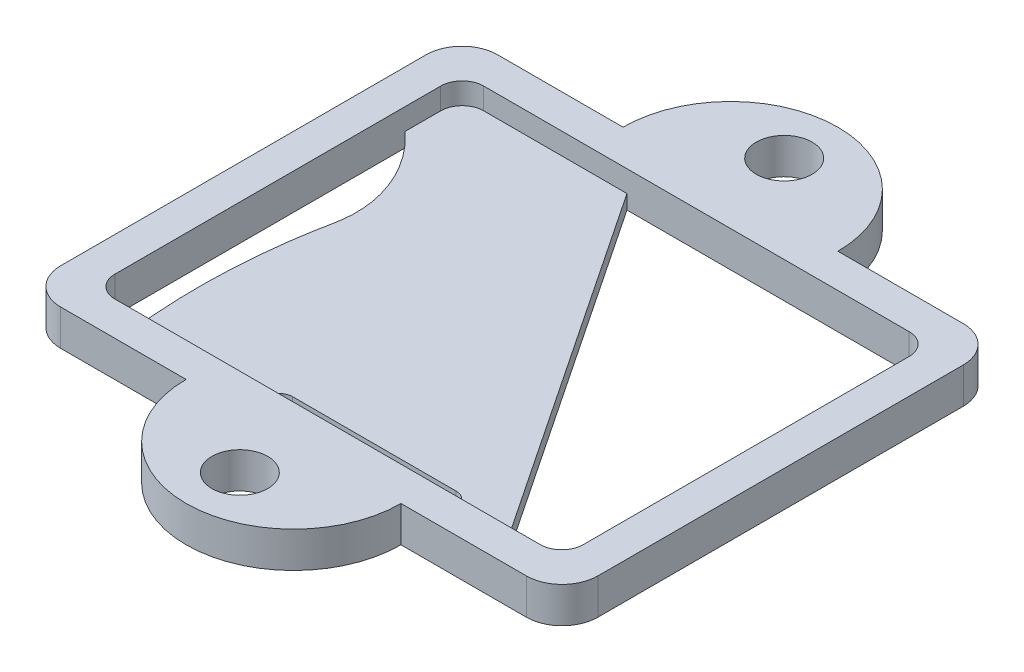
ISO-10303-21;
HEADER;
FILE_DESCRIPTION(('STEP AP214'),'2;1');
FILE_NAME('part.step','',(''),(''),'','','');
FILE_SCHEMA(('AUTOMOTIVE_DESIGN { 1 0 10303 214 1 1 1 1 }'));
ENDSEC;
DATA;
#1=APPLICATION_CONTEXT('core data for automotive mechanical design processes');
#2=APPLICATION_PROTOCOL_DEFINITION('international standard','automotive_design',2000,#1);
#3=PRODUCT_CONTEXT('',#1,'mechanical');
#4=PRODUCT('Part','Part','',(#3));
#5=PRODUCT_RELATED_PRODUCT_CATEGORY('part','',(#4));
#6=PRODUCT_DEFINITION_FORMATION('','',#4);
#7=PRODUCT_DEFINITION_CONTEXT('part definition',#1,'design');
#8=PRODUCT_DEFINITION('design','',#6,#7);
#9=PRODUCT_DEFINITION_SHAPE('','',#8);
#10=(LENGTH_UNIT() NAMED_UNIT(*) SI_UNIT(.MILLI.,.METRE.));
#11=(NAMED_UNIT(*) PLANE_ANGLE_UNIT() SI_UNIT($,.RADIAN.));
#12=(NAMED_UNIT(*) SI_UNIT($,.STERADIAN.) SOLID_ANGLE_UNIT());
#13=UNCERTAINTY_MEASURE_WITH_UNIT(LENGTH_MEASURE(1.E-05),#10,'distance_accuracy_value','');
#14=(GEOMETRIC_REPRESENTATION_CONTEXT(3) GLOBAL_UNCERTAINTY_ASSIGNED_CONTEXT((#13)) GLOBAL_UNIT_ASSIGNED_CONTEXT((#10,
#11,#12)) REPRESENTATION_CONTEXT('',''));
#15=CARTESIAN_POINT('',(0.,0.,0.));
#16=DIRECTION('',(0.,0.,1.));
#17=DIRECTION('',(1.,0.,0.));
#18=AXIS2_PLACEMENT_3D('',#15,#16,#17);
#19=CARTESIAN_POINT('',(0.,2.,0.));
#20=DIRECTION('',(0.,1.,0.));
#21=DIRECTION('',(0.,0.,1.));
#22=AXIS2_PLACEMENT_3D('',#19,#20,#21);
#23=PLANE('',#22);
#24=DIRECTION('',(1.,0.,0.));
#25=VECTOR('',#24,1.);
#26=CARTESIAN_POINT('',(0.,2.,-56.25));
#27=LINE('',#26,#25);
#28=CARTESIAN_POINT('',(-67.2,2.,-56.25));
#29=VERTEX_POINT('',#28);
#30=CARTESIAN_POINT('',(-47.2,2.,-56.25));
#31=VERTEX_POINT('',#30);
#32=EDGE_CURVE('E574',#29,#31,#27,.T.);
#33=ORIENTED_EDGE('',*,*,#32,.F.);
#34=CARTESIAN_POINT('',(-67.2,2.,-53.25));
#35=DIRECTION('',(0.,1.,0.));
#36=DIRECTION('',(0.,0.,1.));
#37=AXIS2_PLACEMENT_3D('',#34,#35,#36);
#38=CIRCLE('',#37,3.);
#39=CARTESIAN_POINT('',(-70.2,2.,-53.25));
#40=VERTEX_POINT('',#39);
#41=EDGE_CURVE('E480',#29,#40,#38,.T.);
#42=ORIENTED_EDGE('',*,*,#41,.T.);
#43=DIRECTION('',(0.,0.,-1.));
#44=VECTOR('',#43,1.);
#45=CARTESIAN_POINT('',(-70.2,2.,0.));
#46=LINE('',#45,#44);
#47=CARTESIAN_POINT('',(-70.2,2.,-48.25));
#48=VERTEX_POINT('',#47);
#49=EDGE_CURVE('E533',#48,#40,#46,.T.);
#50=ORIENTED_EDGE('',*,*,#49,.F.);
#51=CARTESIAN_POINT('',(-70.2,2.,-48.25));
#52=CARTESIAN_POINT('',(-69.3360201996051,2.,-47.3934085351359));
#53=CARTESIAN_POINT('',(-68.4841652961007,2.,-46.5268852184293));
#54=B_SPLINE_CURVE_WITH_KNOTS('',2,(#51,#52,#53),.UNSPECIFIED.,.F.,.F.,(3,3),(0.,
0.0445127924198066),.UNSPECIFIED.);
#55=CARTESIAN_POINT('',(-68.4841652961007,2.,-46.5268852184293));
#56=VERTEX_POINT('',#55);
#57=EDGE_CURVE('E555',#48,#56,#54,.T.);
#58=ORIENTED_EDGE('',*,*,#57,.T.);
#59=CARTESIAN_POINT('',(-70.2,2.,-48.25));
#60=CARTESIAN_POINT('',(-65.7809817664033,2.,-44.3103853015989));
#61=CARTESIAN_POINT('',(-62.8458311822307,2.,-38.221217770015));
#62=CARTESIAN_POINT('',(-64.0829675839587,2.,-32.2701671160842));
#63=B_SPLINE_CURVE_WITH_KNOTS('',3,(#59,#60,#61,#62),.UNSPECIFIED.,.F.,.F.,(4,4),(0.,1.),.UNSPECIFIED.);
#64=CARTESIAN_POINT('',(-64.0606165324306,2.,-32.379972514167));
#65=VERTEX_POINT('',#64);
#66=EDGE_CURVE('E344',#56,#65,#63,.T.);
#67=ORIENTED_EDGE('',*,*,#66,.T.);
#68=CARTESIAN_POINT('',(-65.2,2.,-4.74999999999999));
#69=CARTESIAN_POINT('',(-66.28590342917,2.,-14.1333819415866));
#70=CARTESIAN_POINT('',(-65.9061089399868,2.,-23.3433727796108));
#71=CARTESIAN_POINT('',(-64.0606165324306,2.,-32.379972514167));
#72=B_SPLINE_CURVE_WITH_KNOTS('',3,(#68,#69,#70,#71),.UNSPECIFIED.,.F.,.F.,(4,4),(0.,
0.783884553660671),.UNSPECIFIED.);
#73=CARTESIAN_POINT('',(-65.2,2.,-4.74999999999999));
#74=VERTEX_POINT('',#73);
#75=EDGE_CURVE('E353',#74,#65,#72,.T.);
#76=ORIENTED_EDGE('',*,*,#75,.F.);
#77=DIRECTION('',(1.,0.,0.));
#78=VECTOR('',#77,1.);
#79=CARTESIAN_POINT('',(0.,2.,-4.74999999999999));
#80=LINE('',#79,#78);
#81=CARTESIAN_POINT('',(-47.7958168890493,2.,-4.74999999999999));
#82=VERTEX_POINT('',#81);
#83=EDGE_CURVE('E532',#74,#82,#80,.T.);
#84=ORIENTED_EDGE('',*,*,#83,.T.);
#85=DIRECTION('',(0.,0.,1.));
#86=VECTOR('',#85,1.);
#87=CARTESIAN_POINT('',(-47.7958168890493,2.,0.));
#88=LINE('',#87,#86);
#89=CARTESIAN_POINT('',(-47.7958168890493,2.,-6.54999999999999));
#90=VERTEX_POINT('',#89);
#91=EDGE_CURVE('E298',#90,#82,#88,.T.);
#92=ORIENTED_EDGE('',*,*,#91,.F.);
#93=CARTESIAN_POINT('',(-45.9958168890493,2.,-6.54999999999999));
#94=DIRECTION('',(0.,1.,0.));
#95=DIRECTION('',(0.,0.,1.));
#96=AXIS2_PLACEMENT_3D('',#93,#94,#95);
#97=CIRCLE('',#96,1.8);
#98=CARTESIAN_POINT('',(-45.9958168890493,2.,-8.34999999999999));
#99=VERTEX_POINT('',#98);
#100=EDGE_CURVE('E300',#99,#90,#97,.T.);
#101=ORIENTED_EDGE('',*,*,#100,.F.);
#102=DIRECTION('',(1.,0.,0.));
#103=VECTOR('',#102,1.);
#104=CARTESIAN_POINT('',(0.,2.,-8.34999999999999));
#105=LINE('',#104,#103);
#106=CARTESIAN_POINT('',(-23.1411626663158,2.,-8.34999999999999));
#107=VERTEX_POINT('',#106);
#108=EDGE_CURVE('E313',#99,#107,#105,.T.);
#109=ORIENTED_EDGE('',*,*,#108,.T.);
#110=CARTESIAN_POINT('',(-23.1411626663158,2.,-6.54999999999999));
#111=DIRECTION('',(0.,1.,0.));
#112=DIRECTION('',(0.,0.,1.));
#113=AXIS2_PLACEMENT_3D('',#110,#111,#112);
#114=CIRCLE('',#113,1.8);
#115=CARTESIAN_POINT('',(-21.3411626663158,2.,-6.54999999999999));
#116=VERTEX_POINT('',#115);
#117=EDGE_CURVE('E311',#116,#107,#114,.T.);
#118=ORIENTED_EDGE('',*,*,#117,.F.);
#119=DIRECTION('',(0.,0.,1.));
#120=VECTOR('',#119,1.);
#121=CARTESIAN_POINT('',(-21.3411626663158,2.,0.));
#122=LINE('',#121,#120);
#123=CARTESIAN_POINT('',(-21.3411626663158,2.,-4.74999999999999));
#124=VERTEX_POINT('',#123);
#125=EDGE_CURVE('E279',#116,#124,#122,.T.);
#126=ORIENTED_EDGE('',*,*,#125,.T.);
#127=CARTESIAN_POINT('',(-12.8,2.,-4.74999999999999));
#128=VERTEX_POINT('',#127);
#129=EDGE_CURVE('E529',#124,#128,#80,.T.);
#130=ORIENTED_EDGE('',*,*,#129,.T.);
#131=DIRECTION('',(0.555445204331323,0.,0.831553140205324));
#132=VECTOR('',#131,1.);
#133=CARTESIAN_POINT('',(-6.65701153141222,2.,4.4466251782637));
#134=LINE('',#133,#132);
#135=EDGE_CURVE('E320',#31,#128,#134,.T.);
#136=ORIENTED_EDGE('',*,*,#135,.F.);
#137=EDGE_LOOP('',(#33,#42,#50,#58,#67,#76,#84,#92,#101,#109,#118,#126,#130,#136));
#138=FACE_BOUND('',#137,.T.);
#139=ADVANCED_FACE('F63',(#138),#23,.T.);
#140=CARTESIAN_POINT('',(0.,0.,0.));
#141=DIRECTION('',(0.,1.,0.));
#142=DIRECTION('',(0.,0.,1.));
#143=AXIS2_PLACEMENT_3D('',#140,#141,#142);
#144=PLANE('',#143);
#145=CARTESIAN_POINT('',(-70.2,0.,-48.25));
#146=CARTESIAN_POINT('',(-65.7809817664033,0.,-44.3103853015989));
#147=CARTESIAN_POINT('',(-62.8458311822307,0.,-38.221217770015));
#148=CARTESIAN_POINT('',(-64.0829675839587,0.,-32.2701671160842));
#149=B_SPLINE_CURVE_WITH_KNOTS('',3,(#145,#146,#147,#148),.UNSPECIFIED.,.F.,.F.,(4,4),(0.,1.),.UNSPECIFIED.);
#150=CARTESIAN_POINT('',(-68.4841652961007,0.,-46.5268852184293));
#151=VERTEX_POINT('',#150);
#152=CARTESIAN_POINT('',(-64.0606165324306,0.,-32.379972514167));
#153=VERTEX_POINT('',#152);
#154=EDGE_CURVE('E347',#151,#153,#149,.T.);
#155=ORIENTED_EDGE('',*,*,#154,.F.);
#156=CARTESIAN_POINT('',(-70.2,0.,-48.25));
#157=CARTESIAN_POINT('',(-69.3360201996051,0.,-47.3934085351359));
#158=CARTESIAN_POINT('',(-68.4841652961007,0.,-46.5268852184293));
#159=B_SPLINE_CURVE_WITH_KNOTS('',2,(#156,#157,#158),.UNSPECIFIED.,.F.,.F.,(3,3),(0.,
0.0445127924198066),.UNSPECIFIED.);
#160=CARTESIAN_POINT('',(-70.2,0.,-48.25));
#161=VERTEX_POINT('',#160);
#162=EDGE_CURVE('E352',#161,#151,#159,.T.);
#163=ORIENTED_EDGE('',*,*,#162,.F.);
#164=DIRECTION('',(0.,0.,1.));
#165=VECTOR('',#164,1.);
#166=CARTESIAN_POINT('',(-70.2,0.,0.));
#167=LINE('',#166,#165);
#168=CARTESIAN_POINT('',(-70.2,0.,-7.74999999999999));
#169=VERTEX_POINT('',#168);
#170=EDGE_CURVE('E1007',#161,#169,#167,.T.);
#171=ORIENTED_EDGE('',*,*,#170,.T.);
#172=CARTESIAN_POINT('',(-67.2,0.,-7.74999999999999));
#173=DIRECTION('',(0.,1.,0.));
#174=DIRECTION('',(0.,0.,1.));
#175=AXIS2_PLACEMENT_3D('',#172,#173,#174);
#176=CIRCLE('',#175,3.);
#177=CARTESIAN_POINT('',(-67.2,0.,-4.74999999999999));
#178=VERTEX_POINT('',#177);
#179=EDGE_CURVE('E466',#169,#178,#176,.T.);
#180=ORIENTED_EDGE('',*,*,#179,.T.);
#181=DIRECTION('',(1.,0.,0.));
#182=VECTOR('',#181,1.);
#183=CARTESIAN_POINT('',(0.,0.,-4.74999999999999));
#184=LINE('',#183,#182);
#185=CARTESIAN_POINT('',(-65.2,0.,-4.74999999999999));
#186=VERTEX_POINT('',#185);
#187=EDGE_CURVE('E1003',#178,#186,#184,.T.);
#188=ORIENTED_EDGE('',*,*,#187,.T.);
#189=CARTESIAN_POINT('',(-65.2,0.,-4.74999999999999));
#190=CARTESIAN_POINT('',(-66.28590342917,0.,-14.1333819415866));
#191=CARTESIAN_POINT('',(-65.9061089399868,0.,-23.3433727796108));
#192=CARTESIAN_POINT('',(-64.0606165324306,0.,-32.379972514167));
#193=B_SPLINE_CURVE_WITH_KNOTS('',3,(#189,#190,#191,#192),.UNSPECIFIED.,.F.,.F.,(4,4),(0.,
0.783884553660671),.UNSPECIFIED.);
#194=EDGE_CURVE('E573',#186,#153,#193,.T.);
#195=ORIENTED_EDGE('',*,*,#194,.T.);
#196=EDGE_LOOP('',(#155,#163,#171,#180,#188,#195));
#197=FACE_BOUND('',#196,.T.);
#198=CARTESIAN_POINT('',(-37.5,0.,-68.5));
#199=DIRECTION('',(0.,1.,0.));
#200=DIRECTION('',(0.,0.,1.));
#201=AXIS2_PLACEMENT_3D('',#198,#199,#200);
#202=CIRCLE('',#201,3.9);
#203=CARTESIAN_POINT('',(-37.5,0.,-64.6));
#204=VERTEX_POINT('',#203);
#205=EDGE_CURVE('E550',#204,#204,#202,.T.);
#206=ORIENTED_EDGE('',*,*,#205,.T.);
#207=EDGE_LOOP('',(#206));
#208=FACE_BOUND('',#207,.T.);
#209=DIRECTION('',(0.,0.,-1.));
#210=VECTOR('',#209,1.);
#211=CARTESIAN_POINT('',(-75.,0.,0.));
#212=LINE('',#211,#210);
#213=CARTESIAN_POINT('',(-75.,0.,-5.));
#214=VERTEX_POINT('',#213);
#215=CARTESIAN_POINT('',(-75.,0.,-56.));
#216=VERTEX_POINT('',#215);
#217=EDGE_CURVE('E615',#214,#216,#212,.T.);
#218=ORIENTED_EDGE('',*,*,#217,.T.);
#219=CARTESIAN_POINT('',(-70.,0.,-56.));
#220=DIRECTION('',(0.,1.,0.));
#221=DIRECTION('',(0.,0.,1.));
#222=AXIS2_PLACEMENT_3D('',#219,#220,#221);
#223=CIRCLE('',#222,5.);
#224=CARTESIAN_POINT('',(-70.,0.,-61.));
#225=VERTEX_POINT('',#224);
#226=EDGE_CURVE('E515',#216,#225,#223,.F.);
#227=ORIENTED_EDGE('',*,*,#226,.T.);
#228=DIRECTION('',(-1.,0.,0.));
#229=VECTOR('',#228,1.);
#230=CARTESIAN_POINT('',(0.,0.,-61.));
#231=LINE('',#230,#229);
#232=CARTESIAN_POINT('',(-52.5,0.,-61.));
#233=VERTEX_POINT('',#232);
#234=EDGE_CURVE('E631',#233,#225,#231,.T.);
#235=ORIENTED_EDGE('',*,*,#234,.F.);
#236=CARTESIAN_POINT('',(-37.5,0.,-61.));
#237=DIRECTION('',(0.,1.,0.));
#238=DIRECTION('',(0.,0.,1.));
#239=AXIS2_PLACEMENT_3D('',#236,#237,#238);
#240=CIRCLE('',#239,15.);
#241=CARTESIAN_POINT('',(-22.5,0.,-61.));
#242=VERTEX_POINT('',#241);
#243=EDGE_CURVE('E630',#242,#233,#240,.T.);
#244=ORIENTED_EDGE('',*,*,#243,.F.);
#245=CARTESIAN_POINT('',(-5.,0.,-61.));
#246=VERTEX_POINT('',#245);
#247=EDGE_CURVE('E628',#246,#242,#231,.T.);
#248=ORIENTED_EDGE('',*,*,#247,.F.);
#249=CARTESIAN_POINT('',(-5.,0.,-56.));
#250=DIRECTION('',(0.,1.,0.));
#251=DIRECTION('',(0.,0.,1.));
#252=AXIS2_PLACEMENT_3D('',#249,#250,#251);
#253=CIRCLE('',#252,5.);
#254=CARTESIAN_POINT('',(0.,0.,-56.));
#255=VERTEX_POINT('',#254);
#256=EDGE_CURVE('E521',#246,#255,#253,.F.);
#257=ORIENTED_EDGE('',*,*,#256,.T.);
#258=DIRECTION('',(0.,0.,-1.));
#259=VECTOR('',#258,1.);
#260=CARTESIAN_POINT('',(0.,0.,0.));
#261=LINE('',#260,#259);
#262=CARTESIAN_POINT('',(0.,0.,-5.));
#263=VERTEX_POINT('',#262);
#264=EDGE_CURVE('E625',#263,#255,#261,.T.);
#265=ORIENTED_EDGE('',*,*,#264,.F.);
#266=CARTESIAN_POINT('',(-5.,0.,-5.));
#267=DIRECTION('',(0.,1.,0.));
#268=DIRECTION('',(0.,0.,1.));
#269=AXIS2_PLACEMENT_3D('',#266,#267,#268);
#270=CIRCLE('',#269,5.);
#271=CARTESIAN_POINT('',(-5.,0.,0.));
#272=VERTEX_POINT('',#271);
#273=EDGE_CURVE('E519',#263,#272,#270,.F.);
#274=ORIENTED_EDGE('',*,*,#273,.T.);
#275=DIRECTION('',(-1.,0.,0.));
#276=VECTOR('',#275,1.);
#277=CARTESIAN_POINT('',(0.,0.,0.));
#278=LINE('',#277,#276);
#279=CARTESIAN_POINT('',(-22.5,0.,0.));
#280=VERTEX_POINT('',#279);
#281=EDGE_CURVE('E622',#272,#280,#278,.T.);
#282=ORIENTED_EDGE('',*,*,#281,.T.);
#283=CARTESIAN_POINT('',(-37.5,0.,0.));
#284=DIRECTION('',(0.,1.,0.));
#285=DIRECTION('',(0.,0.,1.));
#286=AXIS2_PLACEMENT_3D('',#283,#284,#285);
#287=CIRCLE('',#286,15.);
#288=CARTESIAN_POINT('',(-52.5,0.,0.));
#289=VERTEX_POINT('',#288);
#290=EDGE_CURVE('E621',#280,#289,#287,.F.);
#291=ORIENTED_EDGE('',*,*,#290,.T.);
#292=CARTESIAN_POINT('',(-70.,0.,0.));
#293=VERTEX_POINT('',#292);
#294=EDGE_CURVE('E618',#289,#293,#278,.T.);
#295=ORIENTED_EDGE('',*,*,#294,.T.);
#296=CARTESIAN_POINT('',(-70.,0.,-5.));
#297=DIRECTION('',(0.,1.,0.));
#298=DIRECTION('',(0.,0.,1.));
#299=AXIS2_PLACEMENT_3D('',#296,#297,#298);
#300=CIRCLE('',#299,5.);
#301=EDGE_CURVE('E517',#293,#214,#300,.F.);
#302=ORIENTED_EDGE('',*,*,#301,.T.);
#303=EDGE_LOOP('',(#218,#227,#235,#244,#248,#257,#265,#274,#282,#291,#295,#302));
#304=FACE_BOUND('',#303,.T.);
#305=CARTESIAN_POINT('',(-37.5,0.,7.50000000000002));
#306=DIRECTION('',(0.,1.,0.));
#307=DIRECTION('',(0.,0.,1.));
#308=AXIS2_PLACEMENT_3D('',#305,#306,#307);
#309=CIRCLE('',#308,3.9);
#310=CARTESIAN_POINT('',(-37.5,0.,11.4));
#311=VERTEX_POINT('',#310);
#312=EDGE_CURVE('E590',#311,#311,#309,.F.);
#313=ORIENTED_EDGE('',*,*,#312,.F.);
#314=EDGE_LOOP('',(#313));
#315=FACE_BOUND('',#314,.T.);
#316=DIRECTION('',(1.,0.,0.));
#317=VECTOR('',#316,1.);
#318=CARTESIAN_POINT('',(0.,0.,-4.74999999999999));
#319=LINE('',#318,#317);
#320=CARTESIAN_POINT('',(-12.8,0.,-4.74999999999999));
#321=VERTEX_POINT('',#320);
#322=CARTESIAN_POINT('',(-7.80000000000001,0.,-4.74999999999999));
#323=VERTEX_POINT('',#322);
#324=EDGE_CURVE('E334',#321,#323,#319,.T.);
#325=ORIENTED_EDGE('',*,*,#324,.T.);
#326=CARTESIAN_POINT('',(-7.80000000000001,0.,-7.74999999999999));
#327=DIRECTION('',(0.,1.,0.));
#328=DIRECTION('',(0.,0.,1.));
#329=AXIS2_PLACEMENT_3D('',#326,#327,#328);
#330=CIRCLE('',#329,3.);
#331=CARTESIAN_POINT('',(-4.80000000000001,0.,-7.74999999999999));
#332=VERTEX_POINT('',#331);
#333=EDGE_CURVE('E85',#323,#332,#330,.T.);
#334=ORIENTED_EDGE('',*,*,#333,.T.);
#335=DIRECTION('',(0.,0.,-1.));
#336=VECTOR('',#335,1.);
#337=CARTESIAN_POINT('',(-4.80000000000001,0.,0.));
#338=LINE('',#337,#336);
#339=CARTESIAN_POINT('',(-4.80000000000001,0.,-53.25));
#340=VERTEX_POINT('',#339);
#341=EDGE_CURVE('E336',#332,#340,#338,.T.);
#342=ORIENTED_EDGE('',*,*,#341,.T.);
#343=CARTESIAN_POINT('',(-7.80000000000001,0.,-53.25));
#344=DIRECTION('',(0.,1.,0.));
#345=DIRECTION('',(0.,0.,1.));
#346=AXIS2_PLACEMENT_3D('',#343,#344,#345);
#347=CIRCLE('',#346,3.);
#348=CARTESIAN_POINT('',(-7.80000000000001,0.,-56.25));
#349=VERTEX_POINT('',#348);
#350=EDGE_CURVE('E12',#340,#349,#347,.T.);
#351=ORIENTED_EDGE('',*,*,#350,.T.);
#352=DIRECTION('',(-1.,0.,0.));
#353=VECTOR('',#352,1.);
#354=CARTESIAN_POINT('',(0.,0.,-56.25));
#355=LINE('',#354,#353);
#356=CARTESIAN_POINT('',(-47.2,0.,-56.25));
#357=VERTEX_POINT('',#356);
#358=EDGE_CURVE('E329',#349,#357,#355,.T.);
#359=ORIENTED_EDGE('',*,*,#358,.T.);
#360=DIRECTION('',(0.555445204331323,0.,0.831553140205324));
#361=VECTOR('',#360,1.);
#362=CARTESIAN_POINT('',(-6.65701153141222,0.,4.4466251782637));
#363=LINE('',#362,#361);
#364=EDGE_CURVE('E331',#357,#321,#363,.T.);
#365=ORIENTED_EDGE('',*,*,#364,.T.);
#366=EDGE_LOOP('',(#325,#334,#342,#351,#359,#365));
#367=FACE_BOUND('',#366,.T.);
#368=DIRECTION('',(0.,0.,1.));
#369=VECTOR('',#368,1.);
#370=CARTESIAN_POINT('',(-21.3411626663158,0.,0.));
#371=LINE('',#370,#369);
#372=CARTESIAN_POINT('',(-21.3411626663158,0.,-6.54999999999999));
#373=VERTEX_POINT('',#372);
#374=CARTESIAN_POINT('',(-21.3411626663158,0.,-4.74999999999999));
#375=VERTEX_POINT('',#374);
#376=EDGE_CURVE('E276',#373,#375,#371,.T.);
#377=ORIENTED_EDGE('',*,*,#376,.F.);
#378=CARTESIAN_POINT('',(-23.1411626663158,0.,-6.54999999999999));
#379=DIRECTION('',(0.,1.,0.));
#380=DIRECTION('',(0.,0.,1.));
#381=AXIS2_PLACEMENT_3D('',#378,#379,#380);
#382=CIRCLE('',#381,1.8);
#383=CARTESIAN_POINT('',(-23.1411626663158,0.,-8.34999999999999));
#384=VERTEX_POINT('',#383);
#385=EDGE_CURVE('E287',#373,#384,#382,.T.);
#386=ORIENTED_EDGE('',*,*,#385,.T.);
#387=DIRECTION('',(1.,0.,0.));
#388=VECTOR('',#387,1.);
#389=CARTESIAN_POINT('',(0.,0.,-8.34999999999999));
#390=LINE('',#389,#388);
#391=CARTESIAN_POINT('',(-45.9958168890493,0.,-8.34999999999999));
#392=VERTEX_POINT('',#391);
#393=EDGE_CURVE('E292',#392,#384,#390,.T.);
#394=ORIENTED_EDGE('',*,*,#393,.F.);
#395=CARTESIAN_POINT('',(-45.9958168890493,0.,-6.54999999999999));
#396=DIRECTION('',(0.,1.,0.));
#397=DIRECTION('',(0.,0.,1.));
#398=AXIS2_PLACEMENT_3D('',#395,#396,#397);
#399=CIRCLE('',#398,1.8);
#400=CARTESIAN_POINT('',(-47.7958168890493,0.,-6.54999999999999));
#401=VERTEX_POINT('',#400);
#402=EDGE_CURVE('E304',#392,#401,#399,.T.);
#403=ORIENTED_EDGE('',*,*,#402,.T.);
#404=DIRECTION('',(0.,0.,1.));
#405=VECTOR('',#404,1.);
#406=CARTESIAN_POINT('',(-47.7958168890493,0.,0.));
#407=LINE('',#406,#405);
#408=CARTESIAN_POINT('',(-47.7958168890493,0.,-4.74999999999999));
#409=VERTEX_POINT('',#408);
#410=EDGE_CURVE('E307',#401,#409,#407,.T.);
#411=ORIENTED_EDGE('',*,*,#410,.T.);
#412=DIRECTION('',(1.,0.,0.));
#413=VECTOR('',#412,1.);
#414=CARTESIAN_POINT('',(0.,0.,-4.74999999999999));
#415=LINE('',#414,#413);
#416=EDGE_CURVE('E284',#409,#375,#415,.T.);
#417=ORIENTED_EDGE('',*,*,#416,.T.);
#418=EDGE_LOOP('',(#377,#386,#394,#403,#411,#417));
#419=FACE_BOUND('',#418,.T.);
#420=ADVANCED_FACE('F295',(#197,#208,#304,#315,#367,#419),#144,.F.);
#421=CARTESIAN_POINT('',(0.,5.,0.));
#422=DIRECTION('',(0.,1.,0.));
#423=DIRECTION('',(0.,0.,1.));
#424=AXIS2_PLACEMENT_3D('',#421,#422,#423);
#425=PLANE('',#424);
#426=CARTESIAN_POINT('',(-37.5,5.,-68.5));
#427=DIRECTION('',(0.,1.,0.));
#428=DIRECTION('',(0.,0.,1.));
#429=AXIS2_PLACEMENT_3D('',#426,#427,#428);
#430=CIRCLE('',#429,3.9);
#431=CARTESIAN_POINT('',(-37.5,5.,-64.6));
#432=VERTEX_POINT('',#431);
#433=EDGE_CURVE('E586',#432,#432,#430,.T.);
#434=ORIENTED_EDGE('',*,*,#433,.F.);
#435=EDGE_LOOP('',(#434));
#436=FACE_BOUND('',#435,.T.);
#437=DIRECTION('',(-1.,0.,0.));
#438=VECTOR('',#437,1.);
#439=CARTESIAN_POINT('',(0.,5.,-61.));
#440=LINE('',#439,#438);
#441=CARTESIAN_POINT('',(-52.5,5.,-61.));
#442=VERTEX_POINT('',#441);
#443=CARTESIAN_POINT('',(-70.,5.,-61.));
#444=VERTEX_POINT('',#443);
#445=EDGE_CURVE('E606',#442,#444,#440,.T.);
#446=ORIENTED_EDGE('',*,*,#445,.T.);
#447=CARTESIAN_POINT('',(-70.,5.,-56.));
#448=DIRECTION('',(0.,1.,0.));
#449=DIRECTION('',(0.,0.,1.));
#450=AXIS2_PLACEMENT_3D('',#447,#448,#449);
#451=CIRCLE('',#450,5.);
#452=CARTESIAN_POINT('',(-75.,5.,-56.));
#453=VERTEX_POINT('',#452);
#454=EDGE_CURVE('E505',#444,#453,#451,.T.);
#455=ORIENTED_EDGE('',*,*,#454,.T.);
#456=DIRECTION('',(0.,0.,-1.));
#457=VECTOR('',#456,1.);
#458=CARTESIAN_POINT('',(-75.,5.,0.));
#459=LINE('',#458,#457);
#460=CARTESIAN_POINT('',(-75.,5.,-5.));
#461=VERTEX_POINT('',#460);
#462=EDGE_CURVE('E589',#461,#453,#459,.T.);
#463=ORIENTED_EDGE('',*,*,#462,.F.);
#464=CARTESIAN_POINT('',(-70.,5.,-5.));
#465=DIRECTION('',(0.,1.,0.));
#466=DIRECTION('',(0.,0.,1.));
#467=AXIS2_PLACEMENT_3D('',#464,#465,#466);
#468=CIRCLE('',#467,5.);
#469=CARTESIAN_POINT('',(-70.,5.,0.));
#470=VERTEX_POINT('',#469);
#471=EDGE_CURVE('E507',#461,#470,#468,.T.);
#472=ORIENTED_EDGE('',*,*,#471,.T.);
#473=DIRECTION('',(-1.,0.,0.));
#474=VECTOR('',#473,1.);
#475=CARTESIAN_POINT('',(0.,5.,0.));
#476=LINE('',#475,#474);
#477=CARTESIAN_POINT('',(-52.5,5.,0.));
#478=VERTEX_POINT('',#477);
#479=EDGE_CURVE('E593',#478,#470,#476,.T.);
#480=ORIENTED_EDGE('',*,*,#479,.F.);
#481=CARTESIAN_POINT('',(-37.5,5.,0.));
#482=DIRECTION('',(0.,1.,0.));
#483=DIRECTION('',(0.,0.,1.));
#484=AXIS2_PLACEMENT_3D('',#481,#482,#483);
#485=CIRCLE('',#484,15.);
#486=CARTESIAN_POINT('',(-22.5,5.,0.));
#487=VERTEX_POINT('',#486);
#488=EDGE_CURVE('E596',#487,#478,#485,.F.);
#489=ORIENTED_EDGE('',*,*,#488,.F.);
#490=CARTESIAN_POINT('',(-5.,5.,0.));
#491=VERTEX_POINT('',#490);
#492=EDGE_CURVE('E597',#491,#487,#476,.T.);
#493=ORIENTED_EDGE('',*,*,#492,.F.);
#494=CARTESIAN_POINT('',(-5.,5.,-5.));
#495=DIRECTION('',(0.,1.,0.));
#496=DIRECTION('',(0.,0.,1.));
#497=AXIS2_PLACEMENT_3D('',#494,#495,#496);
#498=CIRCLE('',#497,5.);
#499=CARTESIAN_POINT('',(0.,5.,-5.));
#500=VERTEX_POINT('',#499);
#501=EDGE_CURVE('E509',#491,#500,#498,.T.);
#502=ORIENTED_EDGE('',*,*,#501,.T.);
#503=DIRECTION('',(0.,0.,-1.));
#504=VECTOR('',#503,1.);
#505=CARTESIAN_POINT('',(0.,5.,0.));
#506=LINE('',#505,#504);
#507=CARTESIAN_POINT('',(0.,5.,-56.));
#508=VERTEX_POINT('',#507);
#509=EDGE_CURVE('E600',#500,#508,#506,.T.);
#510=ORIENTED_EDGE('',*,*,#509,.T.);
#511=CARTESIAN_POINT('',(-5.,5.,-56.));
#512=DIRECTION('',(0.,1.,0.));
#513=DIRECTION('',(0.,0.,1.));
#514=AXIS2_PLACEMENT_3D('',#511,#512,#513);
#515=CIRCLE('',#514,5.);
#516=CARTESIAN_POINT('',(-5.,5.,-61.));
#517=VERTEX_POINT('',#516);
#518=EDGE_CURVE('E511',#508,#517,#515,.T.);
#519=ORIENTED_EDGE('',*,*,#518,.T.);
#520=CARTESIAN_POINT('',(-22.5,5.,-61.));
#521=VERTEX_POINT('',#520);
#522=EDGE_CURVE('E603',#517,#521,#440,.T.);
#523=ORIENTED_EDGE('',*,*,#522,.T.);
#524=CARTESIAN_POINT('',(-37.5,5.,-61.));
#525=DIRECTION('',(0.,1.,0.));
#526=DIRECTION('',(0.,0.,1.));
#527=AXIS2_PLACEMENT_3D('',#524,#525,#526);
#528=CIRCLE('',#527,15.);
#529=EDGE_CURVE('E605',#521,#442,#528,.T.);
#530=ORIENTED_EDGE('',*,*,#529,.T.);
#531=EDGE_LOOP('',(#446,#455,#463,#472,#480,#489,#493,#502,#510,#519,#523,#530));
#532=FACE_BOUND('',#531,.T.);
#533=CARTESIAN_POINT('',(-37.5,5.,7.50000000000002));
#534=DIRECTION('',(0.,1.,0.));
#535=DIRECTION('',(0.,0.,1.));
#536=AXIS2_PLACEMENT_3D('',#533,#534,#535);
#537=CIRCLE('',#536,3.9);
#538=CARTESIAN_POINT('',(-37.5,5.,11.4));
#539=VERTEX_POINT('',#538);
#540=EDGE_CURVE('E609',#539,#539,#537,.F.);
#541=ORIENTED_EDGE('',*,*,#540,.T.);
#542=EDGE_LOOP('',(#541));
#543=FACE_BOUND('',#542,.T.);
#544=DIRECTION('',(1.,0.,0.));
#545=VECTOR('',#544,1.);
#546=CARTESIAN_POINT('',(0.,5.,-4.74999999999999));
#547=LINE('',#546,#545);
#548=CARTESIAN_POINT('',(-67.2,5.,-4.74999999999999));
#549=VERTEX_POINT('',#548);
#550=CARTESIAN_POINT('',(-7.80000000000001,5.,-4.74999999999999));
#551=VERTEX_POINT('',#550);
#552=EDGE_CURVE('E579',#549,#551,#547,.T.);
#553=ORIENTED_EDGE('',*,*,#552,.F.);
#554=CARTESIAN_POINT('',(-67.2,5.,-7.74999999999999));
#555=DIRECTION('',(0.,1.,0.));
#556=DIRECTION('',(0.,0.,1.));
#557=AXIS2_PLACEMENT_3D('',#554,#555,#556);
#558=CIRCLE('',#557,3.);
#559=CARTESIAN_POINT('',(-70.2,5.,-7.74999999999999));
#560=VERTEX_POINT('',#559);
#561=EDGE_CURVE('E470',#549,#560,#558,.F.);
#562=ORIENTED_EDGE('',*,*,#561,.T.);
#563=DIRECTION('',(0.,0.,-1.));
#564=VECTOR('',#563,1.);
#565=CARTESIAN_POINT('',(-70.2,5.,0.));
#566=LINE('',#565,#564);
#567=CARTESIAN_POINT('',(-70.2,5.,-53.25));
#568=VERTEX_POINT('',#567);
#569=EDGE_CURVE('E583',#560,#568,#566,.T.);
#570=ORIENTED_EDGE('',*,*,#569,.T.);
#571=CARTESIAN_POINT('',(-67.2,5.,-53.25));
#572=DIRECTION('',(0.,1.,0.));
#573=DIRECTION('',(0.,0.,1.));
#574=AXIS2_PLACEMENT_3D('',#571,#572,#573);
#575=CIRCLE('',#574,3.);
#576=CARTESIAN_POINT('',(-67.2,5.,-56.25));
#577=VERTEX_POINT('',#576);
#578=EDGE_CURVE('E472',#568,#577,#575,.F.);
#579=ORIENTED_EDGE('',*,*,#578,.T.);
#580=DIRECTION('',(1.,0.,0.));
#581=VECTOR('',#580,1.);
#582=CARTESIAN_POINT('',(0.,5.,-56.25));
#583=LINE('',#582,#581);
#584=CARTESIAN_POINT('',(-7.80000000000001,5.,-56.25));
#585=VERTEX_POINT('',#584);
#586=EDGE_CURVE('E543',#577,#585,#583,.T.);
#587=ORIENTED_EDGE('',*,*,#586,.T.);
#588=CARTESIAN_POINT('',(-7.80000000000001,5.,-53.25));
#589=DIRECTION('',(0.,1.,0.));
#590=DIRECTION('',(0.,0.,1.));
#591=AXIS2_PLACEMENT_3D('',#588,#589,#590);
#592=CIRCLE('',#591,3.);
#593=CARTESIAN_POINT('',(-4.80000000000001,5.,-53.25));
#594=VERTEX_POINT('',#593);
#595=EDGE_CURVE('E71',#585,#594,#592,.F.);
#596=ORIENTED_EDGE('',*,*,#595,.T.);
#597=DIRECTION('',(0.,0.,-1.));
#598=VECTOR('',#597,1.);
#599=CARTESIAN_POINT('',(-4.80000000000001,5.,0.));
#600=LINE('',#599,#598);
#601=CARTESIAN_POINT('',(-4.80000000000001,5.,-7.74999999999999));
#602=VERTEX_POINT('',#601);
#603=EDGE_CURVE('E575',#602,#594,#600,.T.);
#604=ORIENTED_EDGE('',*,*,#603,.F.);
#605=CARTESIAN_POINT('',(-7.80000000000001,5.,-7.74999999999999));
#606=DIRECTION('',(0.,1.,0.));
#607=DIRECTION('',(0.,0.,1.));
#608=AXIS2_PLACEMENT_3D('',#605,#606,#607);
#609=CIRCLE('',#608,3.);
#610=EDGE_CURVE('E464',#602,#551,#609,.F.);
#611=ORIENTED_EDGE('',*,*,#610,.T.);
#612=EDGE_LOOP('',(#553,#562,#570,#579,#587,#596,#604,#611));
#613=FACE_BOUND('',#612,.T.);
#614=ADVANCED_FACE('F389',(#436,#532,#543,#613),#425,.T.);
#615=CARTESIAN_POINT('',(-75.,5.,0.));
#616=DIRECTION('',(-1.,0.,0.));
#617=DIRECTION('',(0.,0.,1.));
#618=AXIS2_PLACEMENT_3D('',#615,#616,#617);
#619=PLANE('',#618);
#620=ORIENTED_EDGE('',*,*,#462,.T.);
#621=DIRECTION('',(0.,-1.,0.));
#622=VECTOR('',#621,1.);
#623=CARTESIAN_POINT('',(-75.,0.,-56.));
#624=LINE('',#623,#622);
#625=EDGE_CURVE('E523',#453,#216,#624,.T.);
#626=ORIENTED_EDGE('',*,*,#625,.T.);
#627=ORIENTED_EDGE('',*,*,#217,.F.);
#628=DIRECTION('',(0.,-1.,0.));
#629=VECTOR('',#628,1.);
#630=CARTESIAN_POINT('',(-75.,5.,-5.));
#631=LINE('',#630,#629);
#632=EDGE_CURVE('E526',#214,#461,#631,.F.);
#633=ORIENTED_EDGE('',*,*,#632,.T.);
#634=EDGE_LOOP('',(#620,#626,#627,#633));
#635=FACE_BOUND('',#634,.T.);
#636=ADVANCED_FACE('F392',(#635),#619,.T.);
#637=CARTESIAN_POINT('',(0.,5.,0.));
#638=DIRECTION('',(0.,0.,1.));
#639=DIRECTION('',(1.,0.,0.));
#640=AXIS2_PLACEMENT_3D('',#637,#638,#639);
#641=PLANE('',#640);
#642=ORIENTED_EDGE('',*,*,#479,.T.);
#643=DIRECTION('',(0.,-1.,0.));
#644=VECTOR('',#643,1.);
#645=CARTESIAN_POINT('',(-70.,5.,0.));
#646=LINE('',#645,#644);
#647=EDGE_CURVE('E502',#470,#293,#646,.T.);
#648=ORIENTED_EDGE('',*,*,#647,.T.);
#649=ORIENTED_EDGE('',*,*,#294,.F.);
#650=DIRECTION('',(0.,-1.,0.));
#651=VECTOR('',#650,1.);
#652=CARTESIAN_POINT('',(-52.5,5.,0.));
#653=LINE('',#652,#651);
#654=EDGE_CURVE('E528',#478,#289,#653,.T.);
#655=ORIENTED_EDGE('',*,*,#654,.F.);
#656=EDGE_LOOP('',(#642,#648,#649,#655));
#657=FACE_BOUND('',#656,.T.);
#658=ADVANCED_FACE('F419',(#657),#641,.T.);
#659=CARTESIAN_POINT('',(-37.5,5.,0.));
#660=DIRECTION('',(0.,-1.,0.));
#661=DIRECTION('',(0.,0.,-1.));
#662=AXIS2_PLACEMENT_3D('',#659,#660,#661);
#663=CYLINDRICAL_SURFACE('',#662,15.);
#664=ORIENTED_EDGE('',*,*,#290,.F.);
#665=DIRECTION('',(0.,-1.,0.));
#666=VECTOR('',#665,1.);
#667=CARTESIAN_POINT('',(-22.5,5.,0.));
#668=LINE('',#667,#666);
#669=EDGE_CURVE('E641',#487,#280,#668,.T.);
#670=ORIENTED_EDGE('',*,*,#669,.F.);
#671=ORIENTED_EDGE('',*,*,#488,.T.);
#672=ORIENTED_EDGE('',*,*,#654,.T.);
#673=EDGE_LOOP('',(#664,#670,#671,#672));
#674=FACE_BOUND('',#673,.T.);
#675=ADVANCED_FACE('F417',(#674),#663,.T.);
#676=ORIENTED_EDGE('',*,*,#281,.F.);
#677=DIRECTION('',(0.,-1.,0.));
#678=VECTOR('',#677,1.);
#679=CARTESIAN_POINT('',(-5.,5.,0.));
#680=LINE('',#679,#678);
#681=EDGE_CURVE('E495',#272,#491,#680,.F.);
#682=ORIENTED_EDGE('',*,*,#681,.T.);
#683=ORIENTED_EDGE('',*,*,#492,.T.);
#684=ORIENTED_EDGE('',*,*,#669,.T.);
#685=EDGE_LOOP('',(#676,#682,#683,#684));
#686=FACE_BOUND('',#685,.T.);
#687=ADVANCED_FACE('F413',(#686),#641,.T.);
#688=CARTESIAN_POINT('',(0.,5.,0.));
#689=DIRECTION('',(-1.,0.,0.));
#690=DIRECTION('',(0.,0.,1.));
#691=AXIS2_PLACEMENT_3D('',#688,#689,#690);
#692=PLANE('',#691);
#693=ORIENTED_EDGE('',*,*,#509,.F.);
#694=DIRECTION('',(0.,-1.,0.));
#695=VECTOR('',#694,1.);
#696=CARTESIAN_POINT('',(0.,0.,-5.));
#697=LINE('',#696,#695);
#698=EDGE_CURVE('E497',#500,#263,#697,.T.);
#699=ORIENTED_EDGE('',*,*,#698,.T.);
#700=ORIENTED_EDGE('',*,*,#264,.T.);
#701=DIRECTION('',(0.,-1.,0.));
#702=VECTOR('',#701,1.);
#703=CARTESIAN_POINT('',(0.,5.,-56.));
#704=LINE('',#703,#702);
#705=EDGE_CURVE('E500',#255,#508,#704,.F.);
#706=ORIENTED_EDGE('',*,*,#705,.T.);
#707=EDGE_LOOP('',(#693,#699,#700,#706));
#708=FACE_BOUND('',#707,.T.);
#709=ADVANCED_FACE('F410',(#708),#692,.F.);
#710=CARTESIAN_POINT('',(0.,5.,-61.));
#711=DIRECTION('',(0.,0.,1.));
#712=DIRECTION('',(1.,0.,0.));
#713=AXIS2_PLACEMENT_3D('',#710,#711,#712);
#714=PLANE('',#713);
#715=ORIENTED_EDGE('',*,*,#522,.F.);
#716=DIRECTION('',(0.,-1.,0.));
#717=VECTOR('',#716,1.);
#718=CARTESIAN_POINT('',(-5.,5.,-61.));
#719=LINE('',#718,#717);
#720=EDGE_CURVE('E492',#517,#246,#719,.T.);
#721=ORIENTED_EDGE('',*,*,#720,.T.);
#722=ORIENTED_EDGE('',*,*,#247,.T.);
#723=DIRECTION('',(0.,-1.,0.));
#724=VECTOR('',#723,1.);
#725=CARTESIAN_POINT('',(-22.5,5.,-61.));
#726=LINE('',#725,#724);
#727=EDGE_CURVE('E638',#521,#242,#726,.T.);
#728=ORIENTED_EDGE('',*,*,#727,.F.);
#729=EDGE_LOOP('',(#715,#721,#722,#728));
#730=FACE_BOUND('',#729,.T.);
#731=ADVANCED_FACE('F406',(#730),#714,.F.);
#732=CARTESIAN_POINT('',(-37.5,5.,-61.));
#733=DIRECTION('',(0.,-1.,0.));
#734=DIRECTION('',(0.,0.,-1.));
#735=AXIS2_PLACEMENT_3D('',#732,#733,#734);
#736=CYLINDRICAL_SURFACE('',#735,15.);
#737=ORIENTED_EDGE('',*,*,#243,.T.);
#738=DIRECTION('',(0.,-1.,0.));
#739=VECTOR('',#738,1.);
#740=CARTESIAN_POINT('',(-52.5,5.,-61.));
#741=LINE('',#740,#739);
#742=EDGE_CURVE('E612',#442,#233,#741,.T.);
#743=ORIENTED_EDGE('',*,*,#742,.F.);
#744=ORIENTED_EDGE('',*,*,#529,.F.);
#745=ORIENTED_EDGE('',*,*,#727,.T.);
#746=EDGE_LOOP('',(#737,#743,#744,#745));
#747=FACE_BOUND('',#746,.T.);
#748=ADVANCED_FACE('F404',(#747),#736,.T.);
#749=ORIENTED_EDGE('',*,*,#234,.T.);
#750=DIRECTION('',(0.,-1.,0.));
#751=VECTOR('',#750,1.);
#752=CARTESIAN_POINT('',(-70.,5.,-61.));
#753=LINE('',#752,#751);
#754=EDGE_CURVE('E513',#225,#444,#753,.F.);
#755=ORIENTED_EDGE('',*,*,#754,.T.);
#756=ORIENTED_EDGE('',*,*,#445,.F.);
#757=ORIENTED_EDGE('',*,*,#742,.T.);
#758=EDGE_LOOP('',(#749,#755,#756,#757));
#759=FACE_BOUND('',#758,.T.);
#760=ADVANCED_FACE('F401',(#759),#714,.F.);
#761=CARTESIAN_POINT('',(-37.5,5.,-68.5));
#762=DIRECTION('',(0.,-1.,0.));
#763=DIRECTION('',(0.,0.,-1.));
#764=AXIS2_PLACEMENT_3D('',#761,#762,#763);
#765=CYLINDRICAL_SURFACE('',#764,3.9);
#766=ORIENTED_EDGE('',*,*,#433,.T.);
#767=EDGE_LOOP('',(#766));
#768=FACE_BOUND('',#767,.T.);
#769=ORIENTED_EDGE('',*,*,#205,.F.);
#770=EDGE_LOOP('',(#769));
#771=FACE_BOUND('',#770,.T.);
#772=ADVANCED_FACE('F399',(#768,#771),#765,.F.);
#773=CARTESIAN_POINT('',(-37.5,5.,7.50000000000002));
#774=DIRECTION('',(0.,-1.,0.));
#775=DIRECTION('',(0.,0.,-1.));
#776=AXIS2_PLACEMENT_3D('',#773,#774,#775);
#777=CYLINDRICAL_SURFACE('',#776,3.9);
#778=ORIENTED_EDGE('',*,*,#540,.F.);
#779=EDGE_LOOP('',(#778));
#780=FACE_BOUND('',#779,.T.);
#781=ORIENTED_EDGE('',*,*,#312,.T.);
#782=EDGE_LOOP('',(#781));
#783=FACE_BOUND('',#782,.T.);
#784=ADVANCED_FACE('F387',(#780,#783),#777,.F.);
#785=CARTESIAN_POINT('',(0.,2.,-56.25));
#786=DIRECTION('',(0.,0.,1.));
#787=DIRECTION('',(1.,0.,0.));
#788=AXIS2_PLACEMENT_3D('',#785,#786,#787);
#789=PLANE('',#788);
#790=ORIENTED_EDGE('',*,*,#586,.F.);
#791=DIRECTION('',(0.,1.,0.));
#792=VECTOR('',#791,1.);
#793=CARTESIAN_POINT('',(-67.2,2.,-56.25));
#794=LINE('',#793,#792);
#795=EDGE_CURVE('E482',#577,#29,#794,.F.);
#796=ORIENTED_EDGE('',*,*,#795,.T.);
#797=ORIENTED_EDGE('',*,*,#32,.T.);
#798=DIRECTION('',(0.,1.,0.));
#799=VECTOR('',#798,1.);
#800=CARTESIAN_POINT('',(-47.2,0.,-56.25));
#801=LINE('',#800,#799);
#802=EDGE_CURVE('E338',#357,#31,#801,.T.);
#803=ORIENTED_EDGE('',*,*,#802,.F.);
#804=ORIENTED_EDGE('',*,*,#358,.F.);
#805=DIRECTION('',(0.,1.,0.));
#806=VECTOR('',#805,1.);
#807=CARTESIAN_POINT('',(-7.80000000000001,2.,-56.25));
#808=LINE('',#807,#806);
#809=EDGE_CURVE('E484',#349,#585,#808,.T.);
#810=ORIENTED_EDGE('',*,*,#809,.T.);
#811=EDGE_LOOP('',(#790,#796,#797,#803,#804,#810));
#812=FACE_BOUND('',#811,.T.);
#813=ADVANCED_FACE('F378',(#812),#789,.T.);
#814=CARTESIAN_POINT('',(-4.80000000000001,2.,0.));
#815=DIRECTION('',(1.,0.,0.));
#816=DIRECTION('',(0.,0.,-1.));
#817=AXIS2_PLACEMENT_3D('',#814,#815,#816);
#818=PLANE('',#817);
#819=ORIENTED_EDGE('',*,*,#341,.F.);
#820=DIRECTION('',(0.,1.,0.));
#821=VECTOR('',#820,1.);
#822=CARTESIAN_POINT('',(-4.80000000000001,5.,-7.74999999999999));
#823=LINE('',#822,#821);
#824=EDGE_CURVE('E463',#332,#602,#823,.T.);
#825=ORIENTED_EDGE('',*,*,#824,.T.);
#826=ORIENTED_EDGE('',*,*,#603,.T.);
#827=DIRECTION('',(0.,1.,0.));
#828=VECTOR('',#827,1.);
#829=CARTESIAN_POINT('',(-4.80000000000001,2.,-53.25));
#830=LINE('',#829,#828);
#831=EDGE_CURVE('E78',#594,#340,#830,.F.);
#832=ORIENTED_EDGE('',*,*,#831,.T.);
#833=EDGE_LOOP('',(#819,#825,#826,#832));
#834=FACE_BOUND('',#833,.T.);
#835=ADVANCED_FACE('F374',(#834),#818,.F.);
#836=CARTESIAN_POINT('',(0.,2.,-4.74999999999999));
#837=DIRECTION('',(0.,0.,1.));
#838=DIRECTION('',(1.,0.,0.));
#839=AXIS2_PLACEMENT_3D('',#836,#837,#838);
#840=PLANE('',#839);
#841=ORIENTED_EDGE('',*,*,#187,.F.);
#842=DIRECTION('',(0.,1.,0.));
#843=VECTOR('',#842,1.);
#844=CARTESIAN_POINT('',(-67.2,2.,-4.74999999999999));
#845=LINE('',#844,#843);
#846=EDGE_CURVE('E476',#178,#549,#845,.T.);
#847=ORIENTED_EDGE('',*,*,#846,.T.);
#848=ORIENTED_EDGE('',*,*,#552,.T.);
#849=DIRECTION('',(0.,1.,0.));
#850=VECTOR('',#849,1.);
#851=CARTESIAN_POINT('',(-7.80000000000001,0.,-4.74999999999999));
#852=LINE('',#851,#850);
#853=EDGE_CURVE('E461',#551,#323,#852,.F.);
#854=ORIENTED_EDGE('',*,*,#853,.T.);
#855=ORIENTED_EDGE('',*,*,#324,.F.);
#856=DIRECTION('',(0.,1.,0.));
#857=VECTOR('',#856,1.);
#858=CARTESIAN_POINT('',(-12.8,0.,-4.74999999999999));
#859=LINE('',#858,#857);
#860=EDGE_CURVE('E341',#321,#128,#859,.T.);
#861=ORIENTED_EDGE('',*,*,#860,.T.);
#862=ORIENTED_EDGE('',*,*,#129,.F.);
#863=DIRECTION('',(0.,1.,0.));
#864=VECTOR('',#863,1.);
#865=CARTESIAN_POINT('',(-21.3411626663158,0.,-4.74999999999999));
#866=LINE('',#865,#864);
#867=EDGE_CURVE('E318',#375,#124,#866,.T.);
#868=ORIENTED_EDGE('',*,*,#867,.F.);
#869=ORIENTED_EDGE('',*,*,#416,.F.);
#870=DIRECTION('',(0.,1.,0.));
#871=VECTOR('',#870,1.);
#872=CARTESIAN_POINT('',(-47.7958168890493,0.,-4.74999999999999));
#873=LINE('',#872,#871);
#874=EDGE_CURVE('E321',#409,#82,#873,.T.);
#875=ORIENTED_EDGE('',*,*,#874,.T.);
#876=ORIENTED_EDGE('',*,*,#83,.F.);
#877=DIRECTION('',(0.,1.,0.));
#878=VECTOR('',#877,1.);
#879=CARTESIAN_POINT('',(-65.2,0.,-4.74999999999999));
#880=LINE('',#879,#878);
#881=EDGE_CURVE('E556',#186,#74,#880,.T.);
#882=ORIENTED_EDGE('',*,*,#881,.F.);
#883=EDGE_LOOP('',(#841,#847,#848,#854,#855,#861,#862,#868,#869,#875,#876,#882));
#884=FACE_BOUND('',#883,.T.);
#885=ADVANCED_FACE('F377',(#884),#840,.F.);
#886=CARTESIAN_POINT('',(-70.2,2.,0.));
#887=DIRECTION('',(1.,0.,0.));
#888=DIRECTION('',(0.,0.,-1.));
#889=AXIS2_PLACEMENT_3D('',#886,#887,#888);
#890=PLANE('',#889);
#891=ORIENTED_EDGE('',*,*,#49,.T.);
#892=DIRECTION('',(0.,1.,0.));
#893=VECTOR('',#892,1.);
#894=CARTESIAN_POINT('',(-70.2,5.,-53.25));
#895=LINE('',#894,#893);
#896=EDGE_CURVE('E487',#40,#568,#895,.T.);
#897=ORIENTED_EDGE('',*,*,#896,.T.);
#898=ORIENTED_EDGE('',*,*,#569,.F.);
#899=DIRECTION('',(0.,1.,0.));
#900=VECTOR('',#899,1.);
#901=CARTESIAN_POINT('',(-70.2,2.,-7.74999999999999));
#902=LINE('',#901,#900);
#903=EDGE_CURVE('E490',#560,#169,#902,.F.);
#904=ORIENTED_EDGE('',*,*,#903,.T.);
#905=ORIENTED_EDGE('',*,*,#170,.F.);
#906=DIRECTION('',(0.,1.,0.));
#907=VECTOR('',#906,1.);
#908=CARTESIAN_POINT('',(-70.2,0.,-48.25));
#909=LINE('',#908,#907);
#910=EDGE_CURVE('E572',#161,#48,#909,.T.);
#911=ORIENTED_EDGE('',*,*,#910,.T.);
#912=EDGE_LOOP('',(#891,#897,#898,#904,#905,#911));
#913=FACE_BOUND('',#912,.T.);
#914=ADVANCED_FACE('F367',(#913),#890,.T.);
#915=DIRECTION('',(0.,1.,0.));
#916=VECTOR('',#915,1.);
#917=SURFACE_OF_LINEAR_EXTRUSION('',#149,#916);
#918=ORIENTED_EDGE('',*,*,#66,.F.);
#919=DIRECTION('',(0.,1.,0.));
#920=VECTOR('',#919,1.);
#921=CARTESIAN_POINT('',(-68.4841652961007,0.,-46.5268852184293));
#922=LINE('',#921,#920);
#923=EDGE_CURVE('E571',#151,#56,#922,.T.);
#924=ORIENTED_EDGE('',*,*,#923,.F.);
#925=ORIENTED_EDGE('',*,*,#154,.T.);
#926=DIRECTION('',(0.,1.,0.));
#927=VECTOR('',#926,1.);
#928=CARTESIAN_POINT('',(-64.0606165324306,0.,-32.379972514167));
#929=LINE('',#928,#927);
#930=EDGE_CURVE('E566',#153,#65,#929,.T.);
#931=ORIENTED_EDGE('',*,*,#930,.T.);
#932=EDGE_LOOP('',(#918,#924,#925,#931));
#933=FACE_BOUND('',#932,.T.);
#934=ADVANCED_FACE('F362',(#933),#917,.T.);
#935=DIRECTION('',(0.,1.,0.));
#936=VECTOR('',#935,1.);
#937=SURFACE_OF_LINEAR_EXTRUSION('',#193,#936);
#938=ORIENTED_EDGE('',*,*,#75,.T.);
#939=ORIENTED_EDGE('',*,*,#930,.F.);
#940=ORIENTED_EDGE('',*,*,#194,.F.);
#941=ORIENTED_EDGE('',*,*,#881,.T.);
#942=EDGE_LOOP('',(#938,#939,#940,#941));
#943=FACE_BOUND('',#942,.T.);
#944=ADVANCED_FACE('F366',(#943),#937,.F.);
#945=DIRECTION('',(0.,1.,0.));
#946=VECTOR('',#945,1.);
#947=SURFACE_OF_LINEAR_EXTRUSION('',#159,#946);
#948=ORIENTED_EDGE('',*,*,#57,.F.);
#949=ORIENTED_EDGE('',*,*,#910,.F.);
#950=ORIENTED_EDGE('',*,*,#162,.T.);
#951=ORIENTED_EDGE('',*,*,#923,.T.);
#952=EDGE_LOOP('',(#948,#949,#950,#951));
#953=FACE_BOUND('',#952,.T.);
#954=ADVANCED_FACE('F369',(#953),#947,.T.);
#955=CARTESIAN_POINT('',(-6.65701153141222,0.,4.4466251782637));
#956=DIRECTION('',(-0.831553140205324,0.,0.555445204331323));
#957=DIRECTION('',(0.555445204331323,0.,0.831553140205324));
#958=AXIS2_PLACEMENT_3D('',#955,#956,#957);
#959=PLANE('',#958);
#960=ORIENTED_EDGE('',*,*,#135,.T.);
#961=ORIENTED_EDGE('',*,*,#860,.F.);
#962=ORIENTED_EDGE('',*,*,#364,.F.);
#963=ORIENTED_EDGE('',*,*,#802,.T.);
#964=EDGE_LOOP('',(#960,#961,#962,#963));
#965=FACE_BOUND('',#964,.T.);
#966=ADVANCED_FACE('F737',(#965),#959,.F.);
#967=CARTESIAN_POINT('',(-21.3411626663158,0.,0.));
#968=DIRECTION('',(-1.,0.,0.));
#969=DIRECTION('',(0.,0.,1.));
#970=AXIS2_PLACEMENT_3D('',#967,#968,#969);
#971=PLANE('',#970);
#972=ORIENTED_EDGE('',*,*,#125,.F.);
#973=DIRECTION('',(0.,1.,0.));
#974=VECTOR('',#973,1.);
#975=CARTESIAN_POINT('',(-21.3411626663158,0.,-6.54999999999999));
#976=LINE('',#975,#974);
#977=EDGE_CURVE('E272',#373,#116,#976,.T.);
#978=ORIENTED_EDGE('',*,*,#977,.F.);
#979=ORIENTED_EDGE('',*,*,#376,.T.);
#980=ORIENTED_EDGE('',*,*,#867,.T.);
#981=EDGE_LOOP('',(#972,#978,#979,#980));
#982=FACE_BOUND('',#981,.T.);
#983=ADVANCED_FACE('F274',(#982),#971,.T.);
#984=CARTESIAN_POINT('',(-47.7958168890493,0.,0.));
#985=DIRECTION('',(-1.,0.,0.));
#986=DIRECTION('',(0.,0.,1.));
#987=AXIS2_PLACEMENT_3D('',#984,#985,#986);
#988=PLANE('',#987);
#989=ORIENTED_EDGE('',*,*,#91,.T.);
#990=ORIENTED_EDGE('',*,*,#874,.F.);
#991=ORIENTED_EDGE('',*,*,#410,.F.);
#992=DIRECTION('',(0.,1.,0.));
#993=VECTOR('',#992,1.);
#994=CARTESIAN_POINT('',(-47.7958168890493,0.,-6.54999999999999));
#995=LINE('',#994,#993);
#996=EDGE_CURVE('E324',#401,#90,#995,.T.);
#997=ORIENTED_EDGE('',*,*,#996,.T.);
#998=EDGE_LOOP('',(#989,#990,#991,#997));
#999=FACE_BOUND('',#998,.T.);
#1000=ADVANCED_FACE('F751',(#999),#988,.F.);
#1001=CARTESIAN_POINT('',(-45.9958168890493,0.,-6.54999999999999));
#1002=DIRECTION('',(0.,1.,0.));
#1003=DIRECTION('',(0.,0.,1.));
#1004=AXIS2_PLACEMENT_3D('',#1001,#1002,#1003);
#1005=CYLINDRICAL_SURFACE('',#1004,1.8);
#1006=ORIENTED_EDGE('',*,*,#100,.T.);
#1007=ORIENTED_EDGE('',*,*,#996,.F.);
#1008=ORIENTED_EDGE('',*,*,#402,.F.);
#1009=DIRECTION('',(0.,1.,0.));
#1010=VECTOR('',#1009,1.);
#1011=CARTESIAN_POINT('',(-45.9958168890493,0.,-8.34999999999999));
#1012=LINE('',#1011,#1010);
#1013=EDGE_CURVE('E326',#392,#99,#1012,.T.);
#1014=ORIENTED_EDGE('',*,*,#1013,.T.);
#1015=EDGE_LOOP('',(#1006,#1007,#1008,#1014));
#1016=FACE_BOUND('',#1015,.T.);
#1017=ADVANCED_FACE('F758',(#1016),#1005,.F.);
#1018=CARTESIAN_POINT('',(0.,0.,-8.34999999999999));
#1019=DIRECTION('',(0.,0.,1.));
#1020=DIRECTION('',(1.,0.,0.));
#1021=AXIS2_PLACEMENT_3D('',#1018,#1019,#1020);
#1022=PLANE('',#1021);
#1023=ORIENTED_EDGE('',*,*,#108,.F.);
#1024=ORIENTED_EDGE('',*,*,#1013,.F.);
#1025=ORIENTED_EDGE('',*,*,#393,.T.);
#1026=DIRECTION('',(0.,1.,0.));
#1027=VECTOR('',#1026,1.);
#1028=CARTESIAN_POINT('',(-23.1411626663158,0.,-8.34999999999999));
#1029=LINE('',#1028,#1027);
#1030=EDGE_CURVE('E283',#384,#107,#1029,.T.);
#1031=ORIENTED_EDGE('',*,*,#1030,.T.);
#1032=EDGE_LOOP('',(#1023,#1024,#1025,#1031));
#1033=FACE_BOUND('',#1032,.T.);
#1034=ADVANCED_FACE('F766',(#1033),#1022,.T.);
#1035=CARTESIAN_POINT('',(-23.1411626663158,0.,-6.54999999999999));
#1036=DIRECTION('',(0.,1.,0.));
#1037=DIRECTION('',(0.,0.,1.));
#1038=AXIS2_PLACEMENT_3D('',#1035,#1036,#1037);
#1039=CYLINDRICAL_SURFACE('',#1038,1.8);
#1040=ORIENTED_EDGE('',*,*,#117,.T.);
#1041=ORIENTED_EDGE('',*,*,#1030,.F.);
#1042=ORIENTED_EDGE('',*,*,#385,.F.);
#1043=ORIENTED_EDGE('',*,*,#977,.T.);
#1044=EDGE_LOOP('',(#1040,#1041,#1042,#1043));
#1045=FACE_BOUND('',#1044,.T.);
#1046=ADVANCED_FACE('F288',(#1045),#1039,.F.);
#1047=CARTESIAN_POINT('',(-70.,5.,-56.));
#1048=DIRECTION('',(0.,1.,0.));
#1049=DIRECTION('',(0.,0.,1.));
#1050=AXIS2_PLACEMENT_3D('',#1047,#1048,#1049);
#1051=CYLINDRICAL_SURFACE('',#1050,5.);
#1052=ORIENTED_EDGE('',*,*,#454,.F.);
#1053=ORIENTED_EDGE('',*,*,#754,.F.);
#1054=ORIENTED_EDGE('',*,*,#226,.F.);
#1055=ORIENTED_EDGE('',*,*,#625,.F.);
#1056=EDGE_LOOP('',(#1052,#1053,#1054,#1055));
#1057=FACE_BOUND('',#1056,.T.);
#1058=ADVANCED_FACE('F429',(#1057),#1051,.T.);
#1059=CARTESIAN_POINT('',(-70.,5.,-5.));
#1060=DIRECTION('',(0.,-1.,0.));
#1061=DIRECTION('',(0.,0.,-1.));
#1062=AXIS2_PLACEMENT_3D('',#1059,#1060,#1061);
#1063=CYLINDRICAL_SURFACE('',#1062,5.);
#1064=ORIENTED_EDGE('',*,*,#471,.F.);
#1065=ORIENTED_EDGE('',*,*,#632,.F.);
#1066=ORIENTED_EDGE('',*,*,#301,.F.);
#1067=ORIENTED_EDGE('',*,*,#647,.F.);
#1068=EDGE_LOOP('',(#1064,#1065,#1066,#1067));
#1069=FACE_BOUND('',#1068,.T.);
#1070=ADVANCED_FACE('F432',(#1069),#1063,.T.);
#1071=CARTESIAN_POINT('',(-5.,5.,-5.));
#1072=DIRECTION('',(0.,1.,0.));
#1073=DIRECTION('',(0.,0.,1.));
#1074=AXIS2_PLACEMENT_3D('',#1071,#1072,#1073);
#1075=CYLINDRICAL_SURFACE('',#1074,5.);
#1076=ORIENTED_EDGE('',*,*,#501,.F.);
#1077=ORIENTED_EDGE('',*,*,#681,.F.);
#1078=ORIENTED_EDGE('',*,*,#273,.F.);
#1079=ORIENTED_EDGE('',*,*,#698,.F.);
#1080=EDGE_LOOP('',(#1076,#1077,#1078,#1079));
#1081=FACE_BOUND('',#1080,.T.);
#1082=ADVANCED_FACE('F436',(#1081),#1075,.T.);
#1083=CARTESIAN_POINT('',(-5.,5.,-56.));
#1084=DIRECTION('',(0.,-1.,0.));
#1085=DIRECTION('',(0.,0.,-1.));
#1086=AXIS2_PLACEMENT_3D('',#1083,#1084,#1085);
#1087=CYLINDRICAL_SURFACE('',#1086,5.);
#1088=ORIENTED_EDGE('',*,*,#518,.F.);
#1089=ORIENTED_EDGE('',*,*,#705,.F.);
#1090=ORIENTED_EDGE('',*,*,#256,.F.);
#1091=ORIENTED_EDGE('',*,*,#720,.F.);
#1092=EDGE_LOOP('',(#1088,#1089,#1090,#1091));
#1093=FACE_BOUND('',#1092,.T.);
#1094=ADVANCED_FACE('F440',(#1093),#1087,.T.);
#1095=CARTESIAN_POINT('',(-67.2,2.,-53.25));
#1096=DIRECTION('',(0.,-1.,0.));
#1097=DIRECTION('',(0.,0.,-1.));
#1098=AXIS2_PLACEMENT_3D('',#1095,#1096,#1097);
#1099=CYLINDRICAL_SURFACE('',#1098,3.);
#1100=ORIENTED_EDGE('',*,*,#41,.F.);
#1101=ORIENTED_EDGE('',*,*,#795,.F.);
#1102=ORIENTED_EDGE('',*,*,#578,.F.);
#1103=ORIENTED_EDGE('',*,*,#896,.F.);
#1104=EDGE_LOOP('',(#1100,#1101,#1102,#1103));
#1105=FACE_BOUND('',#1104,.T.);
#1106=ADVANCED_FACE('F444',(#1105),#1099,.F.);
#1107=CARTESIAN_POINT('',(-67.2,2.,-7.74999999999999));
#1108=DIRECTION('',(0.,1.,0.));
#1109=DIRECTION('',(0.,0.,1.));
#1110=AXIS2_PLACEMENT_3D('',#1107,#1108,#1109);
#1111=CYLINDRICAL_SURFACE('',#1110,3.);
#1112=ORIENTED_EDGE('',*,*,#179,.F.);
#1113=ORIENTED_EDGE('',*,*,#903,.F.);
#1114=ORIENTED_EDGE('',*,*,#561,.F.);
#1115=ORIENTED_EDGE('',*,*,#846,.F.);
#1116=EDGE_LOOP('',(#1112,#1113,#1114,#1115));
#1117=FACE_BOUND('',#1116,.T.);
#1118=ADVANCED_FACE('F448',(#1117),#1111,.F.);
#1119=CARTESIAN_POINT('',(-7.80000000000001,2.,-7.74999999999999));
#1120=DIRECTION('',(0.,-1.,0.));
#1121=DIRECTION('',(0.,0.,-1.));
#1122=AXIS2_PLACEMENT_3D('',#1119,#1120,#1121);
#1123=CYLINDRICAL_SURFACE('',#1122,3.);
#1124=ORIENTED_EDGE('',*,*,#333,.F.);
#1125=ORIENTED_EDGE('',*,*,#853,.F.);
#1126=ORIENTED_EDGE('',*,*,#610,.F.);
#1127=ORIENTED_EDGE('',*,*,#824,.F.);
#1128=EDGE_LOOP('',(#1124,#1125,#1126,#1127));
#1129=FACE_BOUND('',#1128,.T.);
#1130=ADVANCED_FACE('F451',(#1129),#1123,.F.);
#1131=CARTESIAN_POINT('',(-7.80000000000001,2.,-53.25));
#1132=DIRECTION('',(0.,1.,0.));
#1133=DIRECTION('',(0.,0.,1.));
#1134=AXIS2_PLACEMENT_3D('',#1131,#1132,#1133);
#1135=CYLINDRICAL_SURFACE('',#1134,3.);
#1136=ORIENTED_EDGE('',*,*,#350,.F.);
#1137=ORIENTED_EDGE('',*,*,#831,.F.);
#1138=ORIENTED_EDGE('',*,*,#595,.F.);
#1139=ORIENTED_EDGE('',*,*,#809,.F.);
#1140=EDGE_LOOP('',(#1136,#1137,#1138,#1139));
#1141=FACE_BOUND('',#1140,.T.);
#1142=ADVANCED_FACE('F65',(#1141),#1135,.F.);
#1143=CLOSED_SHELL('',(#139,#420,#614,#636,#658,#675,#687,#709,#731,#748,#760,#772,#784,#813,
#835,#885,#914,#934,#944,#954,#966,#983,#1000,#1017,#1034,#1046,#1058,#1070,#1082,#1094,#1106,
#1118,#1130,#1142));
#1144=MANIFOLD_SOLID_BREP('B2',#1143);
#1145=ADVANCED_BREP_SHAPE_REPRESENTATION('',(#18,#1144),#14);
#1146=SHAPE_DEFINITION_REPRESENTATION(#9,#1145);
ENDSEC;
END-ISO-10303-21;
